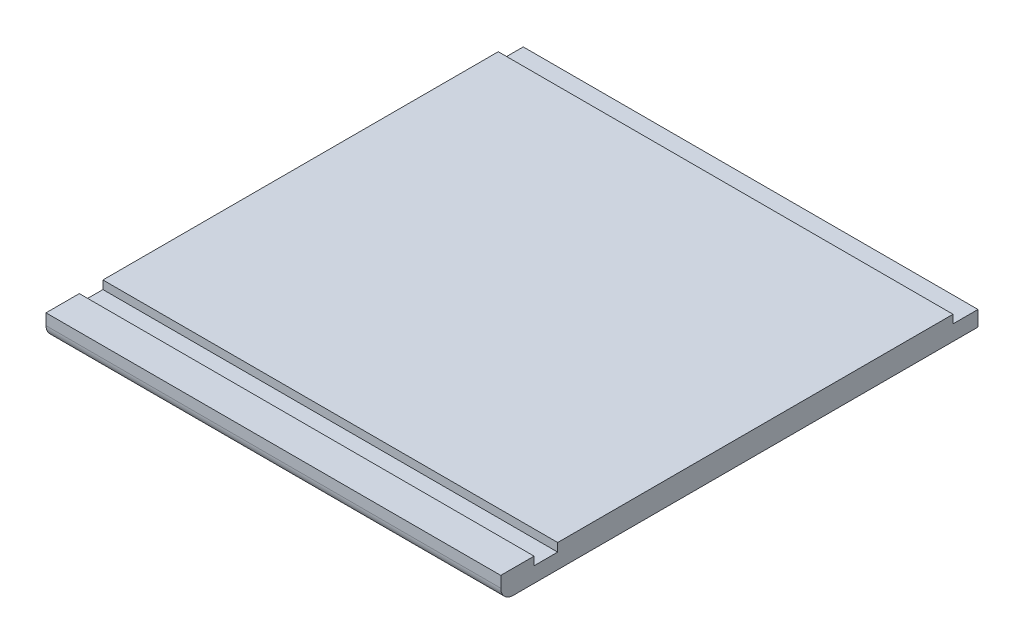
ISO-10303-21;
HEADER;
FILE_DESCRIPTION(('STEP AP214'),'2;1');
FILE_NAME('part.step','',(''),(''),'','','');
FILE_SCHEMA(('AUTOMOTIVE_DESIGN { 1 0 10303 214 1 1 1 1 }'));
ENDSEC;
DATA;
#1=APPLICATION_CONTEXT('core data for automotive mechanical design processes');
#2=APPLICATION_PROTOCOL_DEFINITION('international standard','automotive_design',2000,#1);
#3=PRODUCT_CONTEXT('',#1,'mechanical');
#4=PRODUCT('Part','Part','',(#3));
#5=PRODUCT_RELATED_PRODUCT_CATEGORY('part','',(#4));
#6=PRODUCT_DEFINITION_FORMATION('','',#4);
#7=PRODUCT_DEFINITION_CONTEXT('part definition',#1,'design');
#8=PRODUCT_DEFINITION('design','',#6,#7);
#9=PRODUCT_DEFINITION_SHAPE('','',#8);
#10=(LENGTH_UNIT() NAMED_UNIT(*) SI_UNIT(.MILLI.,.METRE.));
#11=(NAMED_UNIT(*) PLANE_ANGLE_UNIT() SI_UNIT($,.RADIAN.));
#12=(NAMED_UNIT(*) SI_UNIT($,.STERADIAN.) SOLID_ANGLE_UNIT());
#13=UNCERTAINTY_MEASURE_WITH_UNIT(LENGTH_MEASURE(1.E-05),#10,'distance_accuracy_value','');
#14=(GEOMETRIC_REPRESENTATION_CONTEXT(3) GLOBAL_UNCERTAINTY_ASSIGNED_CONTEXT((#13)) GLOBAL_UNIT_ASSIGNED_CONTEXT((#10,
#11,#12)) REPRESENTATION_CONTEXT('',''));
#15=CARTESIAN_POINT('',(0.,0.,0.));
#16=DIRECTION('',(0.,0.,1.));
#17=DIRECTION('',(1.,0.,0.));
#18=AXIS2_PLACEMENT_3D('',#15,#16,#17);
#19=CARTESIAN_POINT('',(0.,18.,0.));
#20=DIRECTION('',(0.,0.,1.));
#21=DIRECTION('',(1.,0.,0.));
#22=AXIS2_PLACEMENT_3D('',#19,#20,#21);
#23=PLANE('',#22);
#24=DIRECTION('',(1.,0.,0.));
#25=VECTOR('',#24,1.);
#26=CARTESIAN_POINT('',(0.,11.65,0.));
#27=LINE('',#26,#25);
#28=CARTESIAN_POINT('',(0.,11.65,0.));
#29=VERTEX_POINT('',#28);
#30=CARTESIAN_POINT('',(346.7,11.65,0.));
#31=VERTEX_POINT('',#30);
#32=EDGE_CURVE('E172',#29,#31,#27,.T.);
#33=ORIENTED_EDGE('',*,*,#32,.T.);
#34=DIRECTION('',(0.,-1.,0.));
#35=VECTOR('',#34,1.);
#36=CARTESIAN_POINT('',(346.7,18.,0.));
#37=LINE('',#36,#35);
#38=CARTESIAN_POINT('',(346.7,0.,0.));
#39=VERTEX_POINT('',#38);
#40=EDGE_CURVE('E137',#31,#39,#37,.T.);
#41=ORIENTED_EDGE('',*,*,#40,.T.);
#42=DIRECTION('',(-1.,0.,0.));
#43=VECTOR('',#42,1.);
#44=CARTESIAN_POINT('',(0.,0.,0.));
#45=LINE('',#44,#43);
#46=CARTESIAN_POINT('',(0.,0.,0.));
#47=VERTEX_POINT('',#46);
#48=EDGE_CURVE('E148',#39,#47,#45,.T.);
#49=ORIENTED_EDGE('',*,*,#48,.T.);
#50=DIRECTION('',(0.,-1.,0.));
#51=VECTOR('',#50,1.);
#52=CARTESIAN_POINT('',(0.,18.,0.));
#53=LINE('',#52,#51);
#54=EDGE_CURVE('E134',#29,#47,#53,.T.);
#55=ORIENTED_EDGE('',*,*,#54,.F.);
#56=EDGE_LOOP('',(#33,#41,#49,#55));
#57=FACE_BOUND('',#56,.T.);
#58=ADVANCED_FACE('F33',(#57),#23,.F.);
#59=CARTESIAN_POINT('',(0.,18.,0.));
#60=DIRECTION('',(0.,1.,0.));
#61=DIRECTION('',(0.,0.,1.));
#62=AXIS2_PLACEMENT_3D('',#59,#60,#61);
#63=PLANE('',#62);
#64=DIRECTION('',(-1.,0.,0.));
#65=VECTOR('',#64,1.);
#66=CARTESIAN_POINT('',(0.,18.,363.85000001));
#67=LINE('',#66,#65);
#68=CARTESIAN_POINT('',(346.7,18.,363.85000001));
#69=VERTEX_POINT('',#68);
#70=CARTESIAN_POINT('',(0.,18.,363.85000001));
#71=VERTEX_POINT('',#70);
#72=EDGE_CURVE('E115',#69,#71,#67,.T.);
#73=ORIENTED_EDGE('',*,*,#72,.F.);
#74=DIRECTION('',(0.,0.,-1.));
#75=VECTOR('',#74,1.);
#76=CARTESIAN_POINT('',(346.7,18.,0.));
#77=LINE('',#76,#75);
#78=CARTESIAN_POINT('',(346.7,18.,338.45000001));
#79=VERTEX_POINT('',#78);
#80=EDGE_CURVE('E125',#69,#79,#77,.T.);
#81=ORIENTED_EDGE('',*,*,#80,.T.);
#82=DIRECTION('',(1.,0.,0.));
#83=VECTOR('',#82,1.);
#84=CARTESIAN_POINT('',(346.7,18.,338.45000001));
#85=LINE('',#84,#83);
#86=CARTESIAN_POINT('',(0.,18.,338.45000001));
#87=VERTEX_POINT('',#86);
#88=EDGE_CURVE('E308',#87,#79,#85,.T.);
#89=ORIENTED_EDGE('',*,*,#88,.F.);
#90=DIRECTION('',(0.,0.,1.));
#91=VECTOR('',#90,1.);
#92=CARTESIAN_POINT('',(0.,18.,0.));
#93=LINE('',#92,#91);
#94=EDGE_CURVE('E128',#87,#71,#93,.T.);
#95=ORIENTED_EDGE('',*,*,#94,.T.);
#96=EDGE_LOOP('',(#73,#81,#89,#95));
#97=FACE_BOUND('',#96,.T.);
#98=ADVANCED_FACE('F123',(#97),#63,.T.);
#99=CARTESIAN_POINT('',(0.,18.,0.));
#100=DIRECTION('',(1.,0.,0.));
#101=DIRECTION('',(0.,0.,-1.));
#102=AXIS2_PLACEMENT_3D('',#99,#100,#101);
#103=PLANE('',#102);
#104=DIRECTION('',(0.,0.,1.));
#105=VECTOR('',#104,1.);
#106=CARTESIAN_POINT('',(0.,0.,0.));
#107=LINE('',#106,#105);
#108=CARTESIAN_POINT('',(0.,0.,354.32500001));
#109=VERTEX_POINT('',#108);
#110=EDGE_CURVE('E144',#47,#109,#107,.T.);
#111=ORIENTED_EDGE('',*,*,#110,.T.);
#112=CARTESIAN_POINT('',(0.,9.525,354.32500001));
#113=DIRECTION('',(1.,0.,0.));
#114=DIRECTION('',(0.,0.,-1.));
#115=AXIS2_PLACEMENT_3D('',#112,#113,#114);
#116=CIRCLE('',#115,9.525);
#117=CARTESIAN_POINT('',(0.,9.525,363.85000001));
#118=VERTEX_POINT('',#117);
#119=EDGE_CURVE('E55',#109,#118,#116,.F.);
#120=ORIENTED_EDGE('',*,*,#119,.T.);
#121=DIRECTION('',(0.,1.,0.));
#122=VECTOR('',#121,1.);
#123=CARTESIAN_POINT('',(0.,0.,363.85000001));
#124=LINE('',#123,#122);
#125=EDGE_CURVE('E120',#118,#71,#124,.T.);
#126=ORIENTED_EDGE('',*,*,#125,.T.);
#127=ORIENTED_EDGE('',*,*,#94,.F.);
#128=DIRECTION('',(0.,1.,0.));
#129=VECTOR('',#128,1.);
#130=CARTESIAN_POINT('',(0.,11.65,338.45000001));
#131=LINE('',#130,#129);
#132=CARTESIAN_POINT('',(0.,11.65,338.45000001));
#133=VERTEX_POINT('',#132);
#134=EDGE_CURVE('E321',#133,#87,#131,.T.);
#135=ORIENTED_EDGE('',*,*,#134,.F.);
#136=DIRECTION('',(0.,0.,1.));
#137=VECTOR('',#136,1.);
#138=CARTESIAN_POINT('',(0.,11.65,338.45000001));
#139=LINE('',#138,#137);
#140=CARTESIAN_POINT('',(0.,11.65,320.45000001));
#141=VERTEX_POINT('',#140);
#142=EDGE_CURVE('E311',#141,#133,#139,.T.);
#143=ORIENTED_EDGE('',*,*,#142,.F.);
#144=DIRECTION('',(0.,1.,0.));
#145=VECTOR('',#144,1.);
#146=CARTESIAN_POINT('',(0.,11.65,320.45000001));
#147=LINE('',#146,#145);
#148=CARTESIAN_POINT('',(0.,18.,320.45000001));
#149=VERTEX_POINT('',#148);
#150=EDGE_CURVE('E323',#141,#149,#147,.T.);
#151=ORIENTED_EDGE('',*,*,#150,.T.);
#152=CARTESIAN_POINT('',(0.,18.,19.05));
#153=VERTEX_POINT('',#152);
#154=EDGE_CURVE('E140',#153,#149,#93,.T.);
#155=ORIENTED_EDGE('',*,*,#154,.F.);
#156=DIRECTION('',(0.,1.,0.));
#157=VECTOR('',#156,1.);
#158=CARTESIAN_POINT('',(0.,-335.572972310301,19.05));
#159=LINE('',#158,#157);
#160=CARTESIAN_POINT('',(0.,11.65,19.05));
#161=VERTEX_POINT('',#160);
#162=EDGE_CURVE('E293',#161,#153,#159,.T.);
#163=ORIENTED_EDGE('',*,*,#162,.F.);
#164=DIRECTION('',(0.,0.,-1.));
#165=VECTOR('',#164,1.);
#166=CARTESIAN_POINT('',(0.,11.65,0.));
#167=LINE('',#166,#165);
#168=EDGE_CURVE('E168',#161,#29,#167,.T.);
#169=ORIENTED_EDGE('',*,*,#168,.T.);
#170=ORIENTED_EDGE('',*,*,#54,.T.);
#171=EDGE_LOOP('',(#111,#120,#126,#127,#135,#143,#151,#155,#163,#169,#170));
#172=FACE_BOUND('',#171,.T.);
#173=ADVANCED_FACE('F163',(#172),#103,.F.);
#174=CARTESIAN_POINT('',(346.7,18.,0.));
#175=DIRECTION('',(-1.,0.,0.));
#176=DIRECTION('',(0.,0.,1.));
#177=AXIS2_PLACEMENT_3D('',#174,#175,#176);
#178=PLANE('',#177);
#179=DIRECTION('',(0.,1.,0.));
#180=VECTOR('',#179,1.);
#181=CARTESIAN_POINT('',(346.7,0.,363.85000001));
#182=LINE('',#181,#180);
#183=CARTESIAN_POINT('',(346.7,9.525,363.85000001));
#184=VERTEX_POINT('',#183);
#185=EDGE_CURVE('E112',#184,#69,#182,.T.);
#186=ORIENTED_EDGE('',*,*,#185,.F.);
#187=CARTESIAN_POINT('',(346.7,9.525,354.32500001));
#188=DIRECTION('',(-1.,0.,0.));
#189=DIRECTION('',(0.,0.,1.));
#190=AXIS2_PLACEMENT_3D('',#187,#188,#189);
#191=CIRCLE('',#190,9.525);
#192=CARTESIAN_POINT('',(346.7,0.,354.32500001));
#193=VERTEX_POINT('',#192);
#194=EDGE_CURVE('E11',#184,#193,#191,.F.);
#195=ORIENTED_EDGE('',*,*,#194,.T.);
#196=DIRECTION('',(0.,0.,-1.));
#197=VECTOR('',#196,1.);
#198=CARTESIAN_POINT('',(346.7,0.,0.));
#199=LINE('',#198,#197);
#200=EDGE_CURVE('E146',#193,#39,#199,.T.);
#201=ORIENTED_EDGE('',*,*,#200,.T.);
#202=ORIENTED_EDGE('',*,*,#40,.F.);
#203=DIRECTION('',(0.,0.,1.));
#204=VECTOR('',#203,1.);
#205=CARTESIAN_POINT('',(346.7,11.65,0.));
#206=LINE('',#205,#204);
#207=CARTESIAN_POINT('',(346.7,11.65,19.05));
#208=VERTEX_POINT('',#207);
#209=EDGE_CURVE('E175',#31,#208,#206,.T.);
#210=ORIENTED_EDGE('',*,*,#209,.T.);
#211=DIRECTION('',(0.,1.,0.));
#212=VECTOR('',#211,1.);
#213=CARTESIAN_POINT('',(346.7,-335.572972310301,19.05));
#214=LINE('',#213,#212);
#215=CARTESIAN_POINT('',(346.7,18.,19.05));
#216=VERTEX_POINT('',#215);
#217=EDGE_CURVE('E296',#208,#216,#214,.T.);
#218=ORIENTED_EDGE('',*,*,#217,.T.);
#219=CARTESIAN_POINT('',(346.7,18.,320.45000001));
#220=VERTEX_POINT('',#219);
#221=EDGE_CURVE('E135',#220,#216,#77,.T.);
#222=ORIENTED_EDGE('',*,*,#221,.F.);
#223=DIRECTION('',(0.,1.,0.));
#224=VECTOR('',#223,1.);
#225=CARTESIAN_POINT('',(346.7,11.65,320.45000001));
#226=LINE('',#225,#224);
#227=CARTESIAN_POINT('',(346.7,11.65,320.45000001));
#228=VERTEX_POINT('',#227);
#229=EDGE_CURVE('E316',#228,#220,#226,.T.);
#230=ORIENTED_EDGE('',*,*,#229,.F.);
#231=DIRECTION('',(0.,0.,-1.));
#232=VECTOR('',#231,1.);
#233=CARTESIAN_POINT('',(346.7,11.65,338.45000001));
#234=LINE('',#233,#232);
#235=CARTESIAN_POINT('',(346.7,11.65,338.45000001));
#236=VERTEX_POINT('',#235);
#237=EDGE_CURVE('E304',#236,#228,#234,.T.);
#238=ORIENTED_EDGE('',*,*,#237,.F.);
#239=DIRECTION('',(0.,1.,0.));
#240=VECTOR('',#239,1.);
#241=CARTESIAN_POINT('',(346.7,11.65,338.45000001));
#242=LINE('',#241,#240);
#243=EDGE_CURVE('E133',#236,#79,#242,.T.);
#244=ORIENTED_EDGE('',*,*,#243,.T.);
#245=ORIENTED_EDGE('',*,*,#80,.F.);
#246=EDGE_LOOP('',(#186,#195,#201,#202,#210,#218,#222,#230,#238,#244,#245));
#247=FACE_BOUND('',#246,.T.);
#248=ADVANCED_FACE('F131',(#247),#178,.F.);
#249=DIRECTION('',(1.,0.,0.));
#250=VECTOR('',#249,1.);
#251=CARTESIAN_POINT('',(0.,18.,19.05));
#252=LINE('',#251,#250);
#253=EDGE_CURVE('E297',#153,#216,#252,.T.);
#254=ORIENTED_EDGE('',*,*,#253,.F.);
#255=ORIENTED_EDGE('',*,*,#154,.T.);
#256=DIRECTION('',(-1.,0.,0.));
#257=VECTOR('',#256,1.);
#258=CARTESIAN_POINT('',(346.7,18.,320.45000001));
#259=LINE('',#258,#257);
#260=EDGE_CURVE('E303',#220,#149,#259,.T.);
#261=ORIENTED_EDGE('',*,*,#260,.F.);
#262=ORIENTED_EDGE('',*,*,#221,.T.);
#263=EDGE_LOOP('',(#254,#255,#261,#262));
#264=FACE_BOUND('',#263,.T.);
#265=ADVANCED_FACE('F188',(#264),#63,.T.);
#266=CARTESIAN_POINT('',(0.,0.,0.));
#267=DIRECTION('',(0.,1.,0.));
#268=DIRECTION('',(0.,0.,1.));
#269=AXIS2_PLACEMENT_3D('',#266,#267,#268);
#270=PLANE('',#269);
#271=ORIENTED_EDGE('',*,*,#200,.F.);
#272=DIRECTION('',(-1.,0.,0.));
#273=VECTOR('',#272,1.);
#274=CARTESIAN_POINT('',(0.,0.,354.32500001));
#275=LINE('',#274,#273);
#276=EDGE_CURVE('E153',#193,#109,#275,.T.);
#277=ORIENTED_EDGE('',*,*,#276,.T.);
#278=ORIENTED_EDGE('',*,*,#110,.F.);
#279=ORIENTED_EDGE('',*,*,#48,.F.);
#280=EDGE_LOOP('',(#271,#277,#278,#279));
#281=FACE_BOUND('',#280,.T.);
#282=ADVANCED_FACE('F160',(#281),#270,.F.);
#283=CARTESIAN_POINT('',(346.7,11.65,338.45000001));
#284=DIRECTION('',(0.,0.,1.));
#285=DIRECTION('',(1.,0.,0.));
#286=AXIS2_PLACEMENT_3D('',#283,#284,#285);
#287=PLANE('',#286);
#288=ORIENTED_EDGE('',*,*,#88,.T.);
#289=ORIENTED_EDGE('',*,*,#243,.F.);
#290=DIRECTION('',(1.,0.,0.));
#291=VECTOR('',#290,1.);
#292=CARTESIAN_POINT('',(346.7,11.65,338.45000001));
#293=LINE('',#292,#291);
#294=EDGE_CURVE('E313',#133,#236,#293,.T.);
#295=ORIENTED_EDGE('',*,*,#294,.F.);
#296=ORIENTED_EDGE('',*,*,#134,.T.);
#297=EDGE_LOOP('',(#288,#289,#295,#296));
#298=FACE_BOUND('',#297,.T.);
#299=ADVANCED_FACE('F214',(#298),#287,.F.);
#300=CARTESIAN_POINT('',(346.7,11.65,320.45000001));
#301=DIRECTION('',(0.,0.,-1.));
#302=DIRECTION('',(-1.,0.,0.));
#303=AXIS2_PLACEMENT_3D('',#300,#301,#302);
#304=PLANE('',#303);
#305=ORIENTED_EDGE('',*,*,#260,.T.);
#306=ORIENTED_EDGE('',*,*,#150,.F.);
#307=DIRECTION('',(-1.,0.,0.));
#308=VECTOR('',#307,1.);
#309=CARTESIAN_POINT('',(346.7,11.65,320.45000001));
#310=LINE('',#309,#308);
#311=EDGE_CURVE('E307',#228,#141,#310,.T.);
#312=ORIENTED_EDGE('',*,*,#311,.F.);
#313=ORIENTED_EDGE('',*,*,#229,.T.);
#314=EDGE_LOOP('',(#305,#306,#312,#313));
#315=FACE_BOUND('',#314,.T.);
#316=ADVANCED_FACE('F221',(#315),#304,.F.);
#317=CARTESIAN_POINT('',(0.,11.65,0.));
#318=DIRECTION('',(0.,1.,0.));
#319=DIRECTION('',(0.,0.,1.));
#320=AXIS2_PLACEMENT_3D('',#317,#318,#319);
#321=PLANE('',#320);
#322=ORIENTED_EDGE('',*,*,#237,.T.);
#323=ORIENTED_EDGE('',*,*,#311,.T.);
#324=ORIENTED_EDGE('',*,*,#142,.T.);
#325=ORIENTED_EDGE('',*,*,#294,.T.);
#326=EDGE_LOOP('',(#322,#323,#324,#325));
#327=FACE_BOUND('',#326,.T.);
#328=ADVANCED_FACE('F229',(#327),#321,.T.);
#329=CARTESIAN_POINT('',(0.,-335.572972310301,19.05));
#330=DIRECTION('',(0.,0.,1.));
#331=DIRECTION('',(1.,0.,0.));
#332=AXIS2_PLACEMENT_3D('',#329,#330,#331);
#333=PLANE('',#332);
#334=DIRECTION('',(-1.,0.,0.));
#335=VECTOR('',#334,1.);
#336=CARTESIAN_POINT('',(0.,11.65,19.05));
#337=LINE('',#336,#335);
#338=EDGE_CURVE('E290',#208,#161,#337,.T.);
#339=ORIENTED_EDGE('',*,*,#338,.T.);
#340=ORIENTED_EDGE('',*,*,#162,.T.);
#341=ORIENTED_EDGE('',*,*,#253,.T.);
#342=ORIENTED_EDGE('',*,*,#217,.F.);
#343=EDGE_LOOP('',(#339,#340,#341,#342));
#344=FACE_BOUND('',#343,.T.);
#345=ADVANCED_FACE('F237',(#344),#333,.F.);
#346=CARTESIAN_POINT('',(0.,11.65,0.));
#347=DIRECTION('',(0.,1.,0.));
#348=DIRECTION('',(0.,0.,1.));
#349=AXIS2_PLACEMENT_3D('',#346,#347,#348);
#350=PLANE('',#349);
#351=ORIENTED_EDGE('',*,*,#168,.F.);
#352=ORIENTED_EDGE('',*,*,#338,.F.);
#353=ORIENTED_EDGE('',*,*,#209,.F.);
#354=ORIENTED_EDGE('',*,*,#32,.F.);
#355=EDGE_LOOP('',(#351,#352,#353,#354));
#356=FACE_BOUND('',#355,.T.);
#357=ADVANCED_FACE('F180',(#356),#350,.T.);
#358=CARTESIAN_POINT('',(0.,0.,363.85000001));
#359=DIRECTION('',(0.,0.,-1.));
#360=DIRECTION('',(-1.,0.,0.));
#361=AXIS2_PLACEMENT_3D('',#358,#359,#360);
#362=PLANE('',#361);
#363=ORIENTED_EDGE('',*,*,#125,.F.);
#364=DIRECTION('',(-1.,0.,0.));
#365=VECTOR('',#364,1.);
#366=CARTESIAN_POINT('',(0.,9.525,363.85000001));
#367=LINE('',#366,#365);
#368=EDGE_CURVE('E41',#118,#184,#367,.F.);
#369=ORIENTED_EDGE('',*,*,#368,.T.);
#370=ORIENTED_EDGE('',*,*,#185,.T.);
#371=ORIENTED_EDGE('',*,*,#72,.T.);
#372=EDGE_LOOP('',(#363,#369,#370,#371));
#373=FACE_BOUND('',#372,.T.);
#374=ADVANCED_FACE('F114',(#373),#362,.F.);
#375=CARTESIAN_POINT('',(0.,9.525,354.32500001));
#376=DIRECTION('',(-1.,0.,0.));
#377=DIRECTION('',(0.,0.,1.));
#378=AXIS2_PLACEMENT_3D('',#375,#376,#377);
#379=CYLINDRICAL_SURFACE('',#378,9.525);
#380=ORIENTED_EDGE('',*,*,#194,.F.);
#381=ORIENTED_EDGE('',*,*,#368,.F.);
#382=ORIENTED_EDGE('',*,*,#119,.F.);
#383=ORIENTED_EDGE('',*,*,#276,.F.);
#384=EDGE_LOOP('',(#380,#381,#382,#383));
#385=FACE_BOUND('',#384,.T.);
#386=ADVANCED_FACE('F35',(#385),#379,.T.);
#387=CLOSED_SHELL('',(#58,#98,#173,#248,#265,#282,#299,#316,#328,#345,#357,#374,#386));
#388=MANIFOLD_SOLID_BREP('B2',#387);
#389=ADVANCED_BREP_SHAPE_REPRESENTATION('',(#18,#388),#14);
#390=SHAPE_DEFINITION_REPRESENTATION(#9,#389);
ENDSEC;
END-ISO-10303-21;
